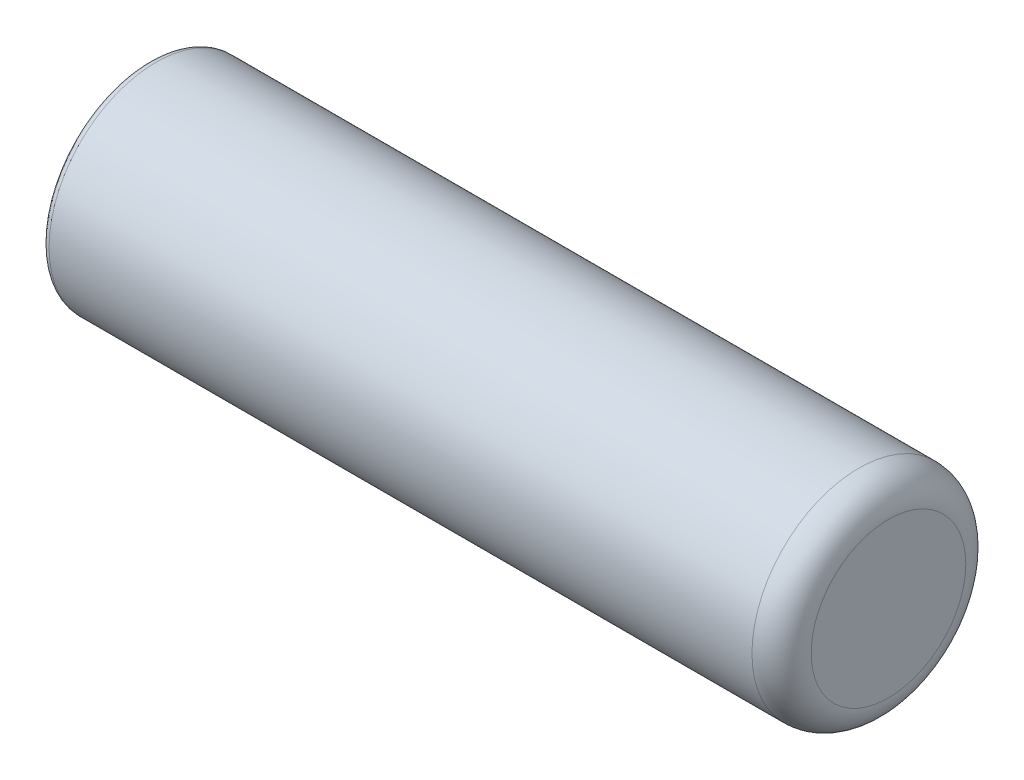
ISO-10303-21;
HEADER;
FILE_DESCRIPTION(('STEP AP214'),'2;1');
FILE_NAME('part.step','',(''),(''),'','','');
FILE_SCHEMA(('AUTOMOTIVE_DESIGN { 1 0 10303 214 1 1 1 1 }'));
ENDSEC;
DATA;
#1=APPLICATION_CONTEXT('core data for automotive mechanical design processes');
#2=APPLICATION_PROTOCOL_DEFINITION('international standard','automotive_design',2000,#1);
#3=PRODUCT_CONTEXT('',#1,'mechanical');
#4=PRODUCT('Part','Part','',(#3));
#5=PRODUCT_RELATED_PRODUCT_CATEGORY('part','',(#4));
#6=PRODUCT_DEFINITION_FORMATION('','',#4);
#7=PRODUCT_DEFINITION_CONTEXT('part definition',#1,'design');
#8=PRODUCT_DEFINITION('design','',#6,#7);
#9=PRODUCT_DEFINITION_SHAPE('','',#8);
#10=(LENGTH_UNIT() NAMED_UNIT(*) SI_UNIT(.MILLI.,.METRE.));
#11=(NAMED_UNIT(*) PLANE_ANGLE_UNIT() SI_UNIT($,.RADIAN.));
#12=(NAMED_UNIT(*) SI_UNIT($,.STERADIAN.) SOLID_ANGLE_UNIT());
#13=UNCERTAINTY_MEASURE_WITH_UNIT(LENGTH_MEASURE(1.E-05),#10,'distance_accuracy_value','');
#14=(GEOMETRIC_REPRESENTATION_CONTEXT(3) GLOBAL_UNCERTAINTY_ASSIGNED_CONTEXT((#13)) GLOBAL_UNIT_ASSIGNED_CONTEXT((#10,
#11,#12)) REPRESENTATION_CONTEXT('',''));
#15=CARTESIAN_POINT('',(0.,0.,0.));
#16=DIRECTION('',(0.,0.,1.));
#17=DIRECTION('',(1.,0.,0.));
#18=AXIS2_PLACEMENT_3D('',#15,#16,#17);
#19=CARTESIAN_POINT('',(100.,0.,0.));
#20=DIRECTION('',(-1.,0.,0.));
#21=DIRECTION('',(0.,0.,1.));
#22=AXIS2_PLACEMENT_3D('',#19,#20,#21);
#23=CYLINDRICAL_SURFACE('',#22,14.45);
#24=CARTESIAN_POINT('',(1.,0.,0.));
#25=DIRECTION('',(1.,0.,0.));
#26=DIRECTION('',(0.,0.,-1.));
#27=AXIS2_PLACEMENT_3D('',#24,#25,#26);
#28=CIRCLE('',#27,14.45);
#29=CARTESIAN_POINT('',(1.,0.,-14.45));
#30=VERTEX_POINT('',#29);
#31=EDGE_CURVE('E38',#30,#30,#28,.T.);
#32=ORIENTED_EDGE('',*,*,#31,.T.);
#33=EDGE_LOOP('',(#32));
#34=FACE_BOUND('',#33,.T.);
#35=CARTESIAN_POINT('',(96.,0.,0.));
#36=DIRECTION('',(1.,0.,0.));
#37=DIRECTION('',(0.,0.,-1.));
#38=AXIS2_PLACEMENT_3D('',#35,#36,#37);
#39=CIRCLE('',#38,14.45);
#40=CARTESIAN_POINT('',(96.,0.,-14.45));
#41=VERTEX_POINT('',#40);
#42=EDGE_CURVE('E42',#41,#41,#39,.F.);
#43=ORIENTED_EDGE('',*,*,#42,.T.);
#44=EDGE_LOOP('',(#43));
#45=FACE_BOUND('',#44,.T.);
#46=ADVANCED_FACE('F31',(#34,#45),#23,.T.);
#47=CARTESIAN_POINT('',(100.,0.,0.));
#48=DIRECTION('',(1.,0.,0.));
#49=DIRECTION('',(0.,0.,-1.));
#50=AXIS2_PLACEMENT_3D('',#47,#48,#49);
#51=PLANE('',#50);
#52=CARTESIAN_POINT('',(100.,0.,0.));
#53=DIRECTION('',(1.,0.,0.));
#54=DIRECTION('',(0.,0.,-1.));
#55=AXIS2_PLACEMENT_3D('',#52,#53,#54);
#56=CIRCLE('',#55,10.45);
#57=CARTESIAN_POINT('',(100.,0.,-10.45));
#58=VERTEX_POINT('',#57);
#59=EDGE_CURVE('E46',#58,#58,#56,.T.);
#60=ORIENTED_EDGE('',*,*,#59,.T.);
#61=EDGE_LOOP('',(#60));
#62=FACE_BOUND('',#61,.T.);
#63=ADVANCED_FACE('F69',(#62),#51,.T.);
#64=CARTESIAN_POINT('',(0.,0.,0.));
#65=DIRECTION('',(1.,0.,0.));
#66=DIRECTION('',(0.,0.,-1.));
#67=AXIS2_PLACEMENT_3D('',#64,#65,#66);
#68=PLANE('',#67);
#69=CARTESIAN_POINT('',(0.,0.,0.));
#70=DIRECTION('',(1.,0.,0.));
#71=DIRECTION('',(0.,0.,-1.));
#72=AXIS2_PLACEMENT_3D('',#69,#70,#71);
#73=CIRCLE('',#72,13.45);
#74=CARTESIAN_POINT('',(0.,0.,-13.45));
#75=VERTEX_POINT('',#74);
#76=EDGE_CURVE('E10',#75,#75,#73,.F.);
#77=ORIENTED_EDGE('',*,*,#76,.T.);
#78=EDGE_LOOP('',(#77));
#79=FACE_BOUND('',#78,.T.);
#80=CARTESIAN_POINT('',(0.,0.,0.));
#81=DIRECTION('',(-1.,0.,0.));
#82=DIRECTION('',(0.,0.,1.));
#83=AXIS2_PLACEMENT_3D('',#80,#81,#82);
#84=CIRCLE('',#83,11.);
#85=CARTESIAN_POINT('',(0.,0.,11.));
#86=VERTEX_POINT('',#85);
#87=EDGE_CURVE('E52',#86,#86,#84,.T.);
#88=ORIENTED_EDGE('',*,*,#87,.F.);
#89=EDGE_LOOP('',(#88));
#90=FACE_BOUND('',#89,.T.);
#91=ADVANCED_FACE('F67',(#79,#90),#68,.F.);
#92=CARTESIAN_POINT('',(96.,0.,0.));
#93=DIRECTION('',(1.,0.,0.));
#94=DIRECTION('',(0.,0.,-1.));
#95=AXIS2_PLACEMENT_3D('',#92,#93,#94);
#96=TOROIDAL_SURFACE('',#95,10.45,4.);
#97=ORIENTED_EDGE('',*,*,#42,.F.);
#98=EDGE_LOOP('',(#97));
#99=FACE_BOUND('',#98,.T.);
#100=ORIENTED_EDGE('',*,*,#59,.F.);
#101=EDGE_LOOP('',(#100));
#102=FACE_BOUND('',#101,.T.);
#103=ADVANCED_FACE('F63',(#99,#102),#96,.T.);
#104=CARTESIAN_POINT('',(80.,0.,0.));
#105=DIRECTION('',(-1.,0.,0.));
#106=DIRECTION('',(0.,0.,1.));
#107=AXIS2_PLACEMENT_3D('',#104,#105,#106);
#108=CYLINDRICAL_SURFACE('',#107,11.);
#109=CARTESIAN_POINT('',(80.,0.,0.));
#110=DIRECTION('',(-1.,0.,0.));
#111=DIRECTION('',(0.,0.,1.));
#112=AXIS2_PLACEMENT_3D('',#109,#110,#111);
#113=CIRCLE('',#112,11.);
#114=CARTESIAN_POINT('',(80.,0.,11.));
#115=VERTEX_POINT('',#114);
#116=EDGE_CURVE('E51',#115,#115,#113,.T.);
#117=ORIENTED_EDGE('',*,*,#116,.F.);
#118=EDGE_LOOP('',(#117));
#119=FACE_BOUND('',#118,.T.);
#120=ORIENTED_EDGE('',*,*,#87,.T.);
#121=EDGE_LOOP('',(#120));
#122=FACE_BOUND('',#121,.T.);
#123=ADVANCED_FACE('F60',(#119,#122),#108,.F.);
#124=CARTESIAN_POINT('',(80.,0.,0.));
#125=DIRECTION('',(-1.,0.,0.));
#126=DIRECTION('',(0.,0.,1.));
#127=AXIS2_PLACEMENT_3D('',#124,#125,#126);
#128=PLANE('',#127);
#129=ORIENTED_EDGE('',*,*,#116,.T.);
#130=EDGE_LOOP('',(#129));
#131=FACE_BOUND('',#130,.T.);
#132=ADVANCED_FACE('F58',(#131),#128,.T.);
#133=CARTESIAN_POINT('',(1.,0.,0.));
#134=DIRECTION('',(1.,0.,0.));
#135=DIRECTION('',(0.,0.,-1.));
#136=AXIS2_PLACEMENT_3D('',#133,#134,#135);
#137=TOROIDAL_SURFACE('',#136,13.45,1.);
#138=ORIENTED_EDGE('',*,*,#76,.F.);
#139=EDGE_LOOP('',(#138));
#140=FACE_BOUND('',#139,.T.);
#141=ORIENTED_EDGE('',*,*,#31,.F.);
#142=EDGE_LOOP('',(#141));
#143=FACE_BOUND('',#142,.T.);
#144=ADVANCED_FACE('F33',(#140,#143),#137,.T.);
#145=CLOSED_SHELL('',(#46,#63,#91,#103,#123,#132,#144));
#146=MANIFOLD_SOLID_BREP('B2',#145);
#147=ADVANCED_BREP_SHAPE_REPRESENTATION('',(#18,#146),#14);
#148=SHAPE_DEFINITION_REPRESENTATION(#9,#147);
ENDSEC;
END-ISO-10303-21;
